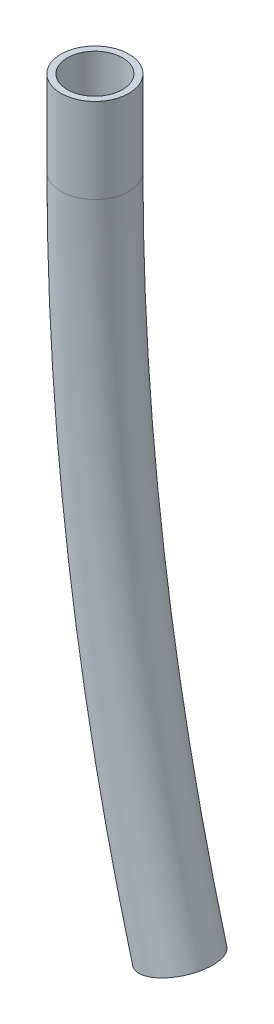
ISO-10303-21;
HEADER;
FILE_DESCRIPTION(('STEP AP214'),'2;1');
FILE_NAME('part.step','',(''),(''),'','','');
FILE_SCHEMA(('AUTOMOTIVE_DESIGN { 1 0 10303 214 1 1 1 1 }'));
ENDSEC;
DATA;
#1=APPLICATION_CONTEXT('core data for automotive mechanical design processes');
#2=APPLICATION_PROTOCOL_DEFINITION('international standard','automotive_design',2000,#1);
#3=PRODUCT_CONTEXT('',#1,'mechanical');
#4=PRODUCT('Part','Part','',(#3));
#5=PRODUCT_RELATED_PRODUCT_CATEGORY('part','',(#4));
#6=PRODUCT_DEFINITION_FORMATION('','',#4);
#7=PRODUCT_DEFINITION_CONTEXT('part definition',#1,'design');
#8=PRODUCT_DEFINITION('design','',#6,#7);
#9=PRODUCT_DEFINITION_SHAPE('','',#8);
#10=(LENGTH_UNIT() NAMED_UNIT(*) SI_UNIT(.MILLI.,.METRE.));
#11=(NAMED_UNIT(*) PLANE_ANGLE_UNIT() SI_UNIT($,.RADIAN.));
#12=(NAMED_UNIT(*) SI_UNIT($,.STERADIAN.) SOLID_ANGLE_UNIT());
#13=UNCERTAINTY_MEASURE_WITH_UNIT(LENGTH_MEASURE(1.E-05),#10,'distance_accuracy_value','');
#14=(GEOMETRIC_REPRESENTATION_CONTEXT(3) GLOBAL_UNCERTAINTY_ASSIGNED_CONTEXT((#13)) GLOBAL_UNIT_ASSIGNED_CONTEXT((#10,
#11,#12)) REPRESENTATION_CONTEXT('',''));
#15=CARTESIAN_POINT('',(0.,0.,0.));
#16=DIRECTION('',(0.,0.,1.));
#17=DIRECTION('',(1.,0.,0.));
#18=AXIS2_PLACEMENT_3D('',#15,#16,#17);
#19=CARTESIAN_POINT('',(0.,0.,0.));
#20=DIRECTION('',(0.,1.,0.));
#21=DIRECTION('',(-1.,0.,0.));
#22=AXIS2_PLACEMENT_3D('',#19,#20,#21);
#23=PLANE('',#22);
#24=CARTESIAN_POINT('',(0.,0.,0.));
#25=DIRECTION('',(0.,1.,0.));
#26=DIRECTION('',(-1.,0.,0.));
#27=AXIS2_PLACEMENT_3D('',#24,#25,#26);
#28=CIRCLE('',#27,6.5);
#29=CARTESIAN_POINT('',(-6.5,0.,0.));
#30=VERTEX_POINT('',#29);
#31=EDGE_CURVE('E66',#30,#30,#28,.T.);
#32=ORIENTED_EDGE('',*,*,#31,.F.);
#33=EDGE_LOOP('',(#32));
#34=FACE_BOUND('',#33,.T.);
#35=CARTESIAN_POINT('',(0.,0.,0.));
#36=DIRECTION('',(0.,1.,0.));
#37=DIRECTION('',(-1.,0.,0.));
#38=AXIS2_PLACEMENT_3D('',#35,#36,#37);
#39=CIRCLE('',#38,8.);
#40=CARTESIAN_POINT('',(-8.,0.,0.));
#41=VERTEX_POINT('',#40);
#42=EDGE_CURVE('E54',#41,#41,#39,.T.);
#43=ORIENTED_EDGE('',*,*,#42,.T.);
#44=EDGE_LOOP('',(#43));
#45=FACE_BOUND('',#44,.T.);
#46=ADVANCED_FACE('F43',(#34,#45),#23,.T.);
#47=CARTESIAN_POINT('',(20.,-170.,0.));
#48=DIRECTION('',(-0.262008733624454,0.965065502183406,0.));
#49=DIRECTION('',(-0.965065502183406,-0.262008733624454,0.));
#50=AXIS2_PLACEMENT_3D('',#47,#48,#49);
#51=PLANE('',#50);
#52=CARTESIAN_POINT('',(20.,-170.,0.));
#53=DIRECTION('',(-0.262008733624454,0.965065502183406,0.));
#54=DIRECTION('',(-0.965065502183406,-0.262008733624454,0.));
#55=AXIS2_PLACEMENT_3D('',#52,#53,#54);
#56=CIRCLE('',#55,6.5);
#57=CARTESIAN_POINT('',(13.7270742358079,-171.703056768559,0.));
#58=VERTEX_POINT('',#57);
#59=EDGE_CURVE('E59',#58,#58,#56,.T.);
#60=ORIENTED_EDGE('',*,*,#59,.T.);
#61=EDGE_LOOP('',(#60));
#62=FACE_BOUND('',#61,.T.);
#63=CARTESIAN_POINT('',(19.9999999999999,-170.,0.));
#64=DIRECTION('',(-0.262008733624454,0.965065502183406,0.));
#65=DIRECTION('',(-0.965065502183406,-0.262008733624454,0.));
#66=AXIS2_PLACEMENT_3D('',#63,#64,#65);
#67=CIRCLE('',#66,8.);
#68=CARTESIAN_POINT('',(12.2794759825327,-172.096069868995,0.));
#69=VERTEX_POINT('',#68);
#70=EDGE_CURVE('E11',#69,#69,#67,.T.);
#71=ORIENTED_EDGE('',*,*,#70,.F.);
#72=EDGE_LOOP('',(#71));
#73=FACE_BOUND('',#72,.T.);
#74=ADVANCED_FACE('F74',(#62,#73),#51,.F.);
#75=CARTESIAN_POINT('',(0.,0.,0.));
#76=DIRECTION('',(0.,-1.,0.));
#77=DIRECTION('',(0.,0.,-1.));
#78=AXIS2_PLACEMENT_3D('',#75,#76,#77);
#79=CYLINDRICAL_SURFACE('',#78,8.);
#80=CARTESIAN_POINT('',(0.,-20.,0.));
#81=DIRECTION('',(0.,-1.,0.));
#82=DIRECTION('',(0.,0.,-1.));
#83=AXIS2_PLACEMENT_3D('',#80,#81,#82);
#84=CIRCLE('',#83,8.);
#85=CARTESIAN_POINT('',(-8.00000000000001,-20.,0.));
#86=VERTEX_POINT('',#85);
#87=EDGE_CURVE('E50',#86,#86,#84,.F.);
#88=ORIENTED_EDGE('',*,*,#87,.T.);
#89=EDGE_LOOP('',(#88));
#90=FACE_BOUND('',#89,.T.);
#91=ORIENTED_EDGE('',*,*,#42,.F.);
#92=EDGE_LOOP('',(#91));
#93=FACE_BOUND('',#92,.T.);
#94=ADVANCED_FACE('F79',(#90,#93),#79,.T.);
#95=CARTESIAN_POINT('',(572.5,-19.9999999999999,0.));
#96=DIRECTION('',(0.,0.,1.));
#97=DIRECTION('',(1.,0.,0.));
#98=AXIS2_PLACEMENT_3D('',#95,#96,#97);
#99=TOROIDAL_SURFACE('',#98,572.5,8.);
#100=CARTESIAN_POINT('',(572.5,-19.9999999999999,0.));
#101=DIRECTION('',(0.,0.,1.));
#102=DIRECTION('',(1.,0.,0.));
#103=AXIS2_PLACEMENT_3D('',#100,#101,#102);
#104=CIRCLE('',#103,580.5);
#105=EDGE_CURVE('',#86,#69,#104,.T.);
#106=ORIENTED_EDGE('',*,*,#87,.F.);
#107=ORIENTED_EDGE('',*,*,#70,.T.);
#108=ORIENTED_EDGE('',*,*,#105,.T.);
#109=ORIENTED_EDGE('',*,*,#105,.F.);
#110=EDGE_LOOP('',(#106,#108,#107,#109));
#111=FACE_BOUND('',#110,.T.);
#112=ADVANCED_FACE('F45',(#111),#99,.T.);
#113=CARTESIAN_POINT('',(0.,0.,0.));
#114=DIRECTION('',(0.,-1.,0.));
#115=DIRECTION('',(0.,0.,-1.));
#116=AXIS2_PLACEMENT_3D('',#113,#114,#115);
#117=CYLINDRICAL_SURFACE('',#116,6.5);
#118=CARTESIAN_POINT('',(0.,-20.,0.));
#119=DIRECTION('',(0.,1.,0.));
#120=DIRECTION('',(-1.,0.,0.));
#121=AXIS2_PLACEMENT_3D('',#118,#119,#120);
#122=CIRCLE('',#121,6.5);
#123=CARTESIAN_POINT('',(-6.49999999999995,-20.,0.));
#124=VERTEX_POINT('',#123);
#125=EDGE_CURVE('E63',#124,#124,#122,.T.);
#126=ORIENTED_EDGE('',*,*,#125,.F.);
#127=EDGE_LOOP('',(#126));
#128=FACE_BOUND('',#127,.T.);
#129=ORIENTED_EDGE('',*,*,#31,.T.);
#130=EDGE_LOOP('',(#129));
#131=FACE_BOUND('',#130,.T.);
#132=ADVANCED_FACE('F70',(#128,#131),#117,.F.);
#133=CARTESIAN_POINT('',(572.5,-19.9999999999999,0.));
#134=DIRECTION('',(0.,0.,1.));
#135=DIRECTION('',(1.,0.,0.));
#136=AXIS2_PLACEMENT_3D('',#133,#134,#135);
#137=TOROIDAL_SURFACE('',#136,572.5,6.5);
#138=CARTESIAN_POINT('',(572.5,-19.9999999999999,0.));
#139=DIRECTION('',(0.,0.,1.));
#140=DIRECTION('',(1.,0.,0.));
#141=AXIS2_PLACEMENT_3D('',#138,#139,#140);
#142=CIRCLE('',#141,579.);
#143=EDGE_CURVE('',#124,#58,#142,.T.);
#144=ORIENTED_EDGE('',*,*,#125,.T.);
#145=ORIENTED_EDGE('',*,*,#59,.F.);
#146=ORIENTED_EDGE('',*,*,#143,.T.);
#147=ORIENTED_EDGE('',*,*,#143,.F.);
#148=EDGE_LOOP('',(#144,#146,#145,#147));
#149=FACE_BOUND('',#148,.T.);
#150=ADVANCED_FACE('F76',(#149),#137,.F.);
#151=CLOSED_SHELL('',(#46,#74,#94,#112,#132,#150));
#152=MANIFOLD_SOLID_BREP('B2',#151);
#153=ADVANCED_BREP_SHAPE_REPRESENTATION('',(#18,#152),#14);
#154=SHAPE_DEFINITION_REPRESENTATION(#9,#153);
ENDSEC;
END-ISO-10303-21;
